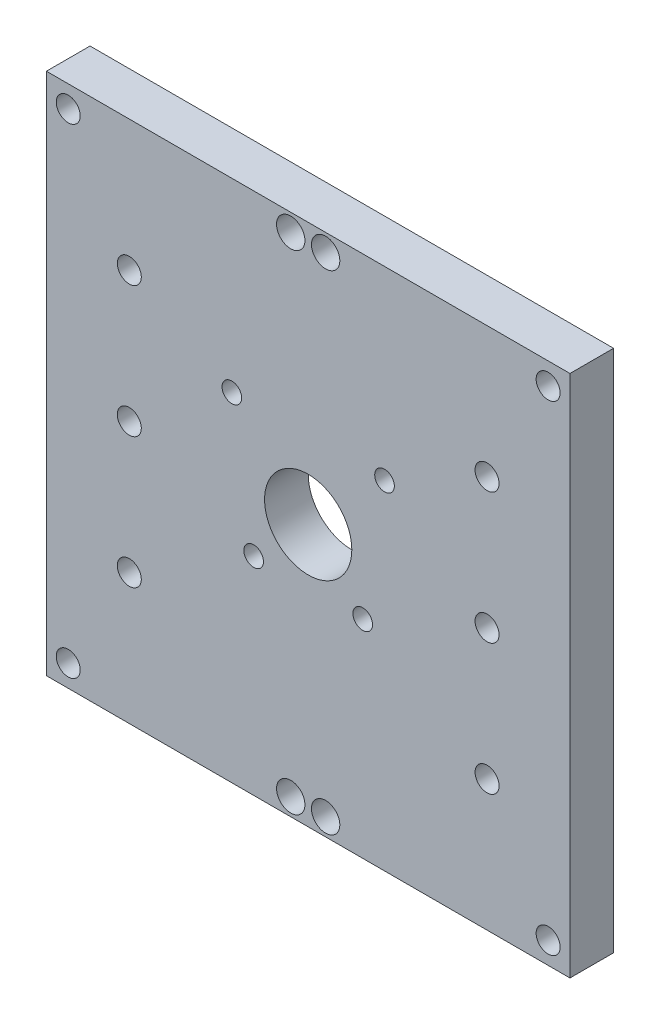
ISO-10303-21;
HEADER;
FILE_DESCRIPTION(('STEP AP214'),'2;1');
FILE_NAME('part.step','',(''),(''),'','','');
FILE_SCHEMA(('AUTOMOTIVE_DESIGN { 1 0 10303 214 1 1 1 1 }'));
ENDSEC;
DATA;
#1=APPLICATION_CONTEXT('core data for automotive mechanical design processes');
#2=APPLICATION_PROTOCOL_DEFINITION('international standard','automotive_design',2000,#1);
#3=PRODUCT_CONTEXT('',#1,'mechanical');
#4=PRODUCT('Part','Part','',(#3));
#5=PRODUCT_RELATED_PRODUCT_CATEGORY('part','',(#4));
#6=PRODUCT_DEFINITION_FORMATION('','',#4);
#7=PRODUCT_DEFINITION_CONTEXT('part definition',#1,'design');
#8=PRODUCT_DEFINITION('design','',#6,#7);
#9=PRODUCT_DEFINITION_SHAPE('','',#8);
#10=(LENGTH_UNIT() NAMED_UNIT(*) SI_UNIT(.MILLI.,.METRE.));
#11=(NAMED_UNIT(*) PLANE_ANGLE_UNIT() SI_UNIT($,.RADIAN.));
#12=(NAMED_UNIT(*) SI_UNIT($,.STERADIAN.) SOLID_ANGLE_UNIT());
#13=UNCERTAINTY_MEASURE_WITH_UNIT(LENGTH_MEASURE(1.E-05),#10,'distance_accuracy_value','');
#14=(GEOMETRIC_REPRESENTATION_CONTEXT(3) GLOBAL_UNCERTAINTY_ASSIGNED_CONTEXT((#13)) GLOBAL_UNIT_ASSIGNED_CONTEXT((#10,
#11,#12)) REPRESENTATION_CONTEXT('',''));
#15=CARTESIAN_POINT('',(0.,0.,0.));
#16=DIRECTION('',(0.,0.,1.));
#17=DIRECTION('',(1.,0.,0.));
#18=AXIS2_PLACEMENT_3D('',#15,#16,#17);
#19=CARTESIAN_POINT('',(60.,120.,5.));
#20=DIRECTION('',(-1.,0.,0.));
#21=DIRECTION('',(0.,0.,1.));
#22=AXIS2_PLACEMENT_3D('',#19,#20,#21);
#23=PLANE('',#22);
#24=DIRECTION('',(0.,0.,-1.));
#25=VECTOR('',#24,1.);
#26=CARTESIAN_POINT('',(60.,0.,5.));
#27=LINE('',#26,#25);
#28=CARTESIAN_POINT('',(60.,0.,5.));
#29=VERTEX_POINT('',#28);
#30=CARTESIAN_POINT('',(60.,0.,-5.));
#31=VERTEX_POINT('',#30);
#32=EDGE_CURVE('E98',#29,#31,#27,.T.);
#33=ORIENTED_EDGE('',*,*,#32,.T.);
#34=DIRECTION('',(0.,-1.,0.));
#35=VECTOR('',#34,1.);
#36=CARTESIAN_POINT('',(60.,120.,-5.));
#37=LINE('',#36,#35);
#38=CARTESIAN_POINT('',(60.,120.,-5.));
#39=VERTEX_POINT('',#38);
#40=EDGE_CURVE('E11',#39,#31,#37,.T.);
#41=ORIENTED_EDGE('',*,*,#40,.F.);
#42=DIRECTION('',(0.,0.,-1.));
#43=VECTOR('',#42,1.);
#44=CARTESIAN_POINT('',(60.,120.,5.));
#45=LINE('',#44,#43);
#46=CARTESIAN_POINT('',(60.,120.,5.));
#47=VERTEX_POINT('',#46);
#48=EDGE_CURVE('E86',#47,#39,#45,.T.);
#49=ORIENTED_EDGE('',*,*,#48,.F.);
#50=DIRECTION('',(0.,-1.,0.));
#51=VECTOR('',#50,1.);
#52=CARTESIAN_POINT('',(60.,120.,5.));
#53=LINE('',#52,#51);
#54=EDGE_CURVE('E94',#47,#29,#53,.T.);
#55=ORIENTED_EDGE('',*,*,#54,.T.);
#56=EDGE_LOOP('',(#33,#41,#49,#55));
#57=FACE_BOUND('',#56,.T.);
#58=ADVANCED_FACE('F35',(#57),#23,.F.);
#59=CARTESIAN_POINT('',(-60.,120.,-5.));
#60=DIRECTION('',(0.,0.,1.));
#61=DIRECTION('',(1.,0.,0.));
#62=AXIS2_PLACEMENT_3D('',#59,#60,#61);
#63=PLANE('',#62);
#64=CARTESIAN_POINT('',(-55.,115.,-5.));
#65=DIRECTION('',(0.,0.,1.));
#66=DIRECTION('',(1.,0.,0.));
#67=AXIS2_PLACEMENT_3D('',#64,#65,#66);
#68=CIRCLE('',#67,2.75);
#69=CARTESIAN_POINT('',(-52.25,115.,-5.));
#70=VERTEX_POINT('',#69);
#71=EDGE_CURVE('E118',#70,#70,#68,.T.);
#72=ORIENTED_EDGE('',*,*,#71,.T.);
#73=EDGE_LOOP('',(#72));
#74=FACE_BOUND('',#73,.T.);
#75=CARTESIAN_POINT('',(-55.,5.,-5.));
#76=DIRECTION('',(0.,0.,1.));
#77=DIRECTION('',(1.,0.,0.));
#78=AXIS2_PLACEMENT_3D('',#75,#76,#77);
#79=CIRCLE('',#78,2.75);
#80=CARTESIAN_POINT('',(-52.25,5.,-5.));
#81=VERTEX_POINT('',#80);
#82=EDGE_CURVE('E124',#81,#81,#79,.T.);
#83=ORIENTED_EDGE('',*,*,#82,.T.);
#84=EDGE_LOOP('',(#83));
#85=FACE_BOUND('',#84,.T.);
#86=CARTESIAN_POINT('',(-41.,60.,-5.));
#87=DIRECTION('',(0.,0.,1.));
#88=DIRECTION('',(1.,0.,0.));
#89=AXIS2_PLACEMENT_3D('',#86,#87,#88);
#90=CIRCLE('',#89,2.75);
#91=CARTESIAN_POINT('',(-38.25,60.,-5.));
#92=VERTEX_POINT('',#91);
#93=EDGE_CURVE('E155',#92,#92,#90,.T.);
#94=ORIENTED_EDGE('',*,*,#93,.T.);
#95=EDGE_LOOP('',(#94));
#96=FACE_BOUND('',#95,.T.);
#97=CARTESIAN_POINT('',(-41.0000000000001,90.,-5.));
#98=DIRECTION('',(0.,0.,1.));
#99=DIRECTION('',(1.,0.,0.));
#100=AXIS2_PLACEMENT_3D('',#97,#98,#99);
#101=CIRCLE('',#100,2.75);
#102=CARTESIAN_POINT('',(-38.2500000000001,90.,-5.));
#103=VERTEX_POINT('',#102);
#104=EDGE_CURVE('E162',#103,#103,#101,.T.);
#105=ORIENTED_EDGE('',*,*,#104,.T.);
#106=EDGE_LOOP('',(#105));
#107=FACE_BOUND('',#106,.T.);
#108=CARTESIAN_POINT('',(0.,60.,-5.));
#109=DIRECTION('',(0.,0.,1.));
#110=DIRECTION('',(1.,0.,0.));
#111=AXIS2_PLACEMENT_3D('',#108,#109,#110);
#112=CIRCLE('',#111,10.);
#113=CARTESIAN_POINT('',(10.,60.,-5.));
#114=VERTEX_POINT('',#113);
#115=EDGE_CURVE('E168',#114,#114,#112,.T.);
#116=ORIENTED_EDGE('',*,*,#115,.T.);
#117=EDGE_LOOP('',(#116));
#118=FACE_BOUND('',#117,.T.);
#119=CARTESIAN_POINT('',(55.,115.,-5.));
#120=DIRECTION('',(0.,0.,1.));
#121=DIRECTION('',(1.,0.,0.));
#122=AXIS2_PLACEMENT_3D('',#119,#120,#121);
#123=CIRCLE('',#122,2.75);
#124=CARTESIAN_POINT('',(57.75,115.,-5.));
#125=VERTEX_POINT('',#124);
#126=EDGE_CURVE('E174',#125,#125,#123,.T.);
#127=ORIENTED_EDGE('',*,*,#126,.T.);
#128=EDGE_LOOP('',(#127));
#129=FACE_BOUND('',#128,.T.);
#130=CARTESIAN_POINT('',(55.,5.,-5.));
#131=DIRECTION('',(0.,0.,1.));
#132=DIRECTION('',(1.,0.,0.));
#133=AXIS2_PLACEMENT_3D('',#130,#131,#132);
#134=CIRCLE('',#133,2.75);
#135=CARTESIAN_POINT('',(57.75,5.,-5.));
#136=VERTEX_POINT('',#135);
#137=EDGE_CURVE('E131',#136,#136,#134,.T.);
#138=ORIENTED_EDGE('',*,*,#137,.T.);
#139=EDGE_LOOP('',(#138));
#140=FACE_BOUND('',#139,.T.);
#141=CARTESIAN_POINT('',(17.5,77.5,-5.));
#142=DIRECTION('',(0.,0.,1.));
#143=DIRECTION('',(1.,0.,0.));
#144=AXIS2_PLACEMENT_3D('',#141,#142,#143);
#145=CIRCLE('',#144,2.25);
#146=CARTESIAN_POINT('',(19.75,77.5,-5.));
#147=VERTEX_POINT('',#146);
#148=EDGE_CURVE('E138',#147,#147,#145,.T.);
#149=ORIENTED_EDGE('',*,*,#148,.T.);
#150=EDGE_LOOP('',(#149));
#151=FACE_BOUND('',#150,.T.);
#152=CARTESIAN_POINT('',(12.5,47.5,-5.));
#153=DIRECTION('',(0.,0.,1.));
#154=DIRECTION('',(1.,0.,0.));
#155=AXIS2_PLACEMENT_3D('',#152,#153,#154);
#156=CIRCLE('',#155,2.25);
#157=CARTESIAN_POINT('',(14.75,47.5,-5.));
#158=VERTEX_POINT('',#157);
#159=EDGE_CURVE('E144',#158,#158,#156,.T.);
#160=ORIENTED_EDGE('',*,*,#159,.T.);
#161=EDGE_LOOP('',(#160));
#162=FACE_BOUND('',#161,.T.);
#163=CARTESIAN_POINT('',(-12.5,47.5,-5.));
#164=DIRECTION('',(0.,0.,1.));
#165=DIRECTION('',(1.,0.,0.));
#166=AXIS2_PLACEMENT_3D('',#163,#164,#165);
#167=CIRCLE('',#166,2.25);
#168=CARTESIAN_POINT('',(-10.25,47.5,-5.));
#169=VERTEX_POINT('',#168);
#170=EDGE_CURVE('E150',#169,#169,#167,.T.);
#171=ORIENTED_EDGE('',*,*,#170,.T.);
#172=EDGE_LOOP('',(#171));
#173=FACE_BOUND('',#172,.T.);
#174=CARTESIAN_POINT('',(3.99999999999999,4.,-5.));
#175=DIRECTION('',(0.,0.,1.));
#176=DIRECTION('',(1.,0.,0.));
#177=AXIS2_PLACEMENT_3D('',#174,#175,#176);
#178=CIRCLE('',#177,3.25);
#179=CARTESIAN_POINT('',(7.24999999999999,4.,-5.));
#180=VERTEX_POINT('',#179);
#181=EDGE_CURVE('E130',#180,#180,#178,.T.);
#182=ORIENTED_EDGE('',*,*,#181,.T.);
#183=EDGE_LOOP('',(#182));
#184=FACE_BOUND('',#183,.T.);
#185=CARTESIAN_POINT('',(-4.00000000000001,4.,-5.));
#186=DIRECTION('',(0.,0.,1.));
#187=DIRECTION('',(1.,0.,0.));
#188=AXIS2_PLACEMENT_3D('',#185,#186,#187);
#189=CIRCLE('',#188,3.25);
#190=CARTESIAN_POINT('',(-0.750000000000007,4.,-5.));
#191=VERTEX_POINT('',#190);
#192=EDGE_CURVE('E208',#191,#191,#189,.T.);
#193=ORIENTED_EDGE('',*,*,#192,.T.);
#194=EDGE_LOOP('',(#193));
#195=FACE_BOUND('',#194,.T.);
#196=CARTESIAN_POINT('',(41.,90.,-5.));
#197=DIRECTION('',(0.,0.,1.));
#198=DIRECTION('',(1.,0.,0.));
#199=AXIS2_PLACEMENT_3D('',#196,#197,#198);
#200=CIRCLE('',#199,2.75);
#201=CARTESIAN_POINT('',(43.75,90.,-5.));
#202=VERTEX_POINT('',#201);
#203=EDGE_CURVE('E214',#202,#202,#200,.T.);
#204=ORIENTED_EDGE('',*,*,#203,.T.);
#205=EDGE_LOOP('',(#204));
#206=FACE_BOUND('',#205,.T.);
#207=CARTESIAN_POINT('',(3.99999999999999,116.,-5.));
#208=DIRECTION('',(0.,0.,1.));
#209=DIRECTION('',(1.,0.,0.));
#210=AXIS2_PLACEMENT_3D('',#207,#208,#209);
#211=CIRCLE('',#210,3.25);
#212=CARTESIAN_POINT('',(7.24999999999999,116.,-5.));
#213=VERTEX_POINT('',#212);
#214=EDGE_CURVE('E220',#213,#213,#211,.T.);
#215=ORIENTED_EDGE('',*,*,#214,.T.);
#216=EDGE_LOOP('',(#215));
#217=FACE_BOUND('',#216,.T.);
#218=CARTESIAN_POINT('',(-4.00000000000001,116.,-5.));
#219=DIRECTION('',(0.,0.,1.));
#220=DIRECTION('',(1.,0.,0.));
#221=AXIS2_PLACEMENT_3D('',#218,#219,#220);
#222=CIRCLE('',#221,3.25);
#223=CARTESIAN_POINT('',(-0.750000000000006,116.,-5.));
#224=VERTEX_POINT('',#223);
#225=EDGE_CURVE('E179',#224,#224,#222,.T.);
#226=ORIENTED_EDGE('',*,*,#225,.T.);
#227=EDGE_LOOP('',(#226));
#228=FACE_BOUND('',#227,.T.);
#229=CARTESIAN_POINT('',(41.,60.,-5.));
#230=DIRECTION('',(0.,0.,1.));
#231=DIRECTION('',(1.,0.,0.));
#232=AXIS2_PLACEMENT_3D('',#229,#230,#231);
#233=CIRCLE('',#232,2.75);
#234=CARTESIAN_POINT('',(43.75,60.,-5.));
#235=VERTEX_POINT('',#234);
#236=EDGE_CURVE('E186',#235,#235,#233,.T.);
#237=ORIENTED_EDGE('',*,*,#236,.T.);
#238=EDGE_LOOP('',(#237));
#239=FACE_BOUND('',#238,.T.);
#240=CARTESIAN_POINT('',(41.,30.,-5.));
#241=DIRECTION('',(0.,0.,1.));
#242=DIRECTION('',(1.,0.,0.));
#243=AXIS2_PLACEMENT_3D('',#240,#241,#242);
#244=CIRCLE('',#243,2.75);
#245=CARTESIAN_POINT('',(43.75,30.,-5.));
#246=VERTEX_POINT('',#245);
#247=EDGE_CURVE('E192',#246,#246,#244,.T.);
#248=ORIENTED_EDGE('',*,*,#247,.T.);
#249=EDGE_LOOP('',(#248));
#250=FACE_BOUND('',#249,.T.);
#251=CARTESIAN_POINT('',(-40.9999999999999,30.,-5.));
#252=DIRECTION('',(0.,0.,1.));
#253=DIRECTION('',(1.,0.,0.));
#254=AXIS2_PLACEMENT_3D('',#251,#252,#253);
#255=CIRCLE('',#254,2.75);
#256=CARTESIAN_POINT('',(-38.2499999999999,30.,-5.));
#257=VERTEX_POINT('',#256);
#258=EDGE_CURVE('E198',#257,#257,#255,.T.);
#259=ORIENTED_EDGE('',*,*,#258,.T.);
#260=EDGE_LOOP('',(#259));
#261=FACE_BOUND('',#260,.T.);
#262=CARTESIAN_POINT('',(-17.5,77.5,-5.));
#263=DIRECTION('',(0.,0.,1.));
#264=DIRECTION('',(1.,0.,0.));
#265=AXIS2_PLACEMENT_3D('',#262,#263,#264);
#266=CIRCLE('',#265,2.25);
#267=CARTESIAN_POINT('',(-15.25,77.5,-5.));
#268=VERTEX_POINT('',#267);
#269=EDGE_CURVE('E101',#268,#268,#266,.T.);
#270=ORIENTED_EDGE('',*,*,#269,.T.);
#271=EDGE_LOOP('',(#270));
#272=FACE_BOUND('',#271,.T.);
#273=DIRECTION('',(-1.,0.,0.));
#274=VECTOR('',#273,1.);
#275=CARTESIAN_POINT('',(-60.,0.,-5.));
#276=LINE('',#275,#274);
#277=CARTESIAN_POINT('',(-60.,0.,-5.));
#278=VERTEX_POINT('',#277);
#279=EDGE_CURVE('E90',#31,#278,#276,.T.);
#280=ORIENTED_EDGE('',*,*,#279,.T.);
#281=DIRECTION('',(0.,-1.,0.));
#282=VECTOR('',#281,1.);
#283=CARTESIAN_POINT('',(-60.,120.,-5.));
#284=LINE('',#283,#282);
#285=CARTESIAN_POINT('',(-60.,120.,-5.));
#286=VERTEX_POINT('',#285);
#287=EDGE_CURVE('E43',#286,#278,#284,.T.);
#288=ORIENTED_EDGE('',*,*,#287,.F.);
#289=DIRECTION('',(-1.,0.,0.));
#290=VECTOR('',#289,1.);
#291=CARTESIAN_POINT('',(-60.,120.,-5.));
#292=LINE('',#291,#290);
#293=EDGE_CURVE('E81',#39,#286,#292,.T.);
#294=ORIENTED_EDGE('',*,*,#293,.F.);
#295=ORIENTED_EDGE('',*,*,#40,.T.);
#296=EDGE_LOOP('',(#280,#288,#294,#295));
#297=FACE_BOUND('',#296,.T.);
#298=ADVANCED_FACE('F89',(#74,#85,#96,#107,#118,#129,#140,#151,#162,#173,#184,#195,#206,#217,
#228,#239,#250,#261,#272,#297),#63,.F.);
#299=CARTESIAN_POINT('',(-60.,120.,5.));
#300=DIRECTION('',(1.,0.,0.));
#301=DIRECTION('',(0.,0.,-1.));
#302=AXIS2_PLACEMENT_3D('',#299,#300,#301);
#303=PLANE('',#302);
#304=DIRECTION('',(0.,0.,1.));
#305=VECTOR('',#304,1.);
#306=CARTESIAN_POINT('',(-60.,0.,5.));
#307=LINE('',#306,#305);
#308=CARTESIAN_POINT('',(-60.,0.,5.));
#309=VERTEX_POINT('',#308);
#310=EDGE_CURVE('E68',#278,#309,#307,.T.);
#311=ORIENTED_EDGE('',*,*,#310,.T.);
#312=DIRECTION('',(0.,-1.,0.));
#313=VECTOR('',#312,1.);
#314=CARTESIAN_POINT('',(-60.,120.,5.));
#315=LINE('',#314,#313);
#316=CARTESIAN_POINT('',(-60.,120.,5.));
#317=VERTEX_POINT('',#316);
#318=EDGE_CURVE('E91',#317,#309,#315,.T.);
#319=ORIENTED_EDGE('',*,*,#318,.F.);
#320=DIRECTION('',(0.,0.,1.));
#321=VECTOR('',#320,1.);
#322=CARTESIAN_POINT('',(-60.,120.,5.));
#323=LINE('',#322,#321);
#324=EDGE_CURVE('E84',#286,#317,#323,.T.);
#325=ORIENTED_EDGE('',*,*,#324,.F.);
#326=ORIENTED_EDGE('',*,*,#287,.T.);
#327=EDGE_LOOP('',(#311,#319,#325,#326));
#328=FACE_BOUND('',#327,.T.);
#329=ADVANCED_FACE('F92',(#328),#303,.F.);
#330=CARTESIAN_POINT('',(-60.,120.,5.));
#331=DIRECTION('',(0.,0.,-1.));
#332=DIRECTION('',(-1.,0.,0.));
#333=AXIS2_PLACEMENT_3D('',#330,#331,#332);
#334=PLANE('',#333);
#335=CARTESIAN_POINT('',(-55.,115.,5.));
#336=DIRECTION('',(0.,0.,1.));
#337=DIRECTION('',(1.,0.,0.));
#338=AXIS2_PLACEMENT_3D('',#335,#336,#337);
#339=CIRCLE('',#338,2.75);
#340=CARTESIAN_POINT('',(-52.25,115.,5.));
#341=VERTEX_POINT('',#340);
#342=EDGE_CURVE('E121',#341,#341,#339,.T.);
#343=ORIENTED_EDGE('',*,*,#342,.F.);
#344=EDGE_LOOP('',(#343));
#345=FACE_BOUND('',#344,.T.);
#346=CARTESIAN_POINT('',(-55.,5.,5.));
#347=DIRECTION('',(0.,0.,1.));
#348=DIRECTION('',(1.,0.,0.));
#349=AXIS2_PLACEMENT_3D('',#346,#347,#348);
#350=CIRCLE('',#349,2.75);
#351=CARTESIAN_POINT('',(-52.25,5.,5.));
#352=VERTEX_POINT('',#351);
#353=EDGE_CURVE('E127',#352,#352,#350,.T.);
#354=ORIENTED_EDGE('',*,*,#353,.F.);
#355=EDGE_LOOP('',(#354));
#356=FACE_BOUND('',#355,.T.);
#357=CARTESIAN_POINT('',(-41.,60.,5.));
#358=DIRECTION('',(0.,0.,1.));
#359=DIRECTION('',(1.,0.,0.));
#360=AXIS2_PLACEMENT_3D('',#357,#358,#359);
#361=CIRCLE('',#360,2.75);
#362=CARTESIAN_POINT('',(-38.25,60.,5.));
#363=VERTEX_POINT('',#362);
#364=EDGE_CURVE('E158',#363,#363,#361,.T.);
#365=ORIENTED_EDGE('',*,*,#364,.F.);
#366=EDGE_LOOP('',(#365));
#367=FACE_BOUND('',#366,.T.);
#368=CARTESIAN_POINT('',(-41.0000000000001,90.,5.));
#369=DIRECTION('',(0.,0.,1.));
#370=DIRECTION('',(1.,0.,0.));
#371=AXIS2_PLACEMENT_3D('',#368,#369,#370);
#372=CIRCLE('',#371,2.75);
#373=CARTESIAN_POINT('',(-38.2500000000001,90.,5.));
#374=VERTEX_POINT('',#373);
#375=EDGE_CURVE('E165',#374,#374,#372,.T.);
#376=ORIENTED_EDGE('',*,*,#375,.F.);
#377=EDGE_LOOP('',(#376));
#378=FACE_BOUND('',#377,.T.);
#379=CARTESIAN_POINT('',(0.,60.,5.));
#380=DIRECTION('',(0.,0.,1.));
#381=DIRECTION('',(1.,0.,0.));
#382=AXIS2_PLACEMENT_3D('',#379,#380,#381);
#383=CIRCLE('',#382,10.);
#384=CARTESIAN_POINT('',(10.,60.,5.));
#385=VERTEX_POINT('',#384);
#386=EDGE_CURVE('E171',#385,#385,#383,.T.);
#387=ORIENTED_EDGE('',*,*,#386,.F.);
#388=EDGE_LOOP('',(#387));
#389=FACE_BOUND('',#388,.T.);
#390=CARTESIAN_POINT('',(55.,115.,5.));
#391=DIRECTION('',(0.,0.,1.));
#392=DIRECTION('',(1.,0.,0.));
#393=AXIS2_PLACEMENT_3D('',#390,#391,#392);
#394=CIRCLE('',#393,2.75);
#395=CARTESIAN_POINT('',(57.75,115.,5.));
#396=VERTEX_POINT('',#395);
#397=EDGE_CURVE('E135',#396,#396,#394,.T.);
#398=ORIENTED_EDGE('',*,*,#397,.F.);
#399=EDGE_LOOP('',(#398));
#400=FACE_BOUND('',#399,.T.);
#401=CARTESIAN_POINT('',(55.,5.,5.));
#402=DIRECTION('',(0.,0.,1.));
#403=DIRECTION('',(1.,0.,0.));
#404=AXIS2_PLACEMENT_3D('',#401,#402,#403);
#405=CIRCLE('',#404,2.75);
#406=CARTESIAN_POINT('',(57.75,5.,5.));
#407=VERTEX_POINT('',#406);
#408=EDGE_CURVE('E134',#407,#407,#405,.T.);
#409=ORIENTED_EDGE('',*,*,#408,.F.);
#410=EDGE_LOOP('',(#409));
#411=FACE_BOUND('',#410,.T.);
#412=CARTESIAN_POINT('',(17.5,77.5,5.));
#413=DIRECTION('',(0.,0.,1.));
#414=DIRECTION('',(1.,0.,0.));
#415=AXIS2_PLACEMENT_3D('',#412,#413,#414);
#416=CIRCLE('',#415,2.25);
#417=CARTESIAN_POINT('',(19.75,77.5,5.));
#418=VERTEX_POINT('',#417);
#419=EDGE_CURVE('E141',#418,#418,#416,.T.);
#420=ORIENTED_EDGE('',*,*,#419,.F.);
#421=EDGE_LOOP('',(#420));
#422=FACE_BOUND('',#421,.T.);
#423=CARTESIAN_POINT('',(12.5,47.5,5.));
#424=DIRECTION('',(0.,0.,1.));
#425=DIRECTION('',(1.,0.,0.));
#426=AXIS2_PLACEMENT_3D('',#423,#424,#425);
#427=CIRCLE('',#426,2.25);
#428=CARTESIAN_POINT('',(14.75,47.5,5.));
#429=VERTEX_POINT('',#428);
#430=EDGE_CURVE('E147',#429,#429,#427,.T.);
#431=ORIENTED_EDGE('',*,*,#430,.F.);
#432=EDGE_LOOP('',(#431));
#433=FACE_BOUND('',#432,.T.);
#434=CARTESIAN_POINT('',(-12.5,47.5,5.));
#435=DIRECTION('',(0.,0.,1.));
#436=DIRECTION('',(1.,0.,0.));
#437=AXIS2_PLACEMENT_3D('',#434,#435,#436);
#438=CIRCLE('',#437,2.25);
#439=CARTESIAN_POINT('',(-10.25,47.5,5.));
#440=VERTEX_POINT('',#439);
#441=EDGE_CURVE('E115',#440,#440,#438,.T.);
#442=ORIENTED_EDGE('',*,*,#441,.F.);
#443=EDGE_LOOP('',(#442));
#444=FACE_BOUND('',#443,.T.);
#445=CARTESIAN_POINT('',(3.99999999999999,4.,5.));
#446=DIRECTION('',(0.,0.,1.));
#447=DIRECTION('',(1.,0.,0.));
#448=AXIS2_PLACEMENT_3D('',#445,#446,#447);
#449=CIRCLE('',#448,3.25);
#450=CARTESIAN_POINT('',(7.24999999999999,4.,5.));
#451=VERTEX_POINT('',#450);
#452=EDGE_CURVE('E205',#451,#451,#449,.T.);
#453=ORIENTED_EDGE('',*,*,#452,.F.);
#454=EDGE_LOOP('',(#453));
#455=FACE_BOUND('',#454,.T.);
#456=CARTESIAN_POINT('',(-4.00000000000001,4.,5.));
#457=DIRECTION('',(0.,0.,1.));
#458=DIRECTION('',(1.,0.,0.));
#459=AXIS2_PLACEMENT_3D('',#456,#457,#458);
#460=CIRCLE('',#459,3.25);
#461=CARTESIAN_POINT('',(-0.750000000000007,4.,5.));
#462=VERTEX_POINT('',#461);
#463=EDGE_CURVE('E211',#462,#462,#460,.T.);
#464=ORIENTED_EDGE('',*,*,#463,.F.);
#465=EDGE_LOOP('',(#464));
#466=FACE_BOUND('',#465,.T.);
#467=CARTESIAN_POINT('',(41.,90.,5.));
#468=DIRECTION('',(0.,0.,1.));
#469=DIRECTION('',(1.,0.,0.));
#470=AXIS2_PLACEMENT_3D('',#467,#468,#469);
#471=CIRCLE('',#470,2.75);
#472=CARTESIAN_POINT('',(43.75,90.,5.));
#473=VERTEX_POINT('',#472);
#474=EDGE_CURVE('E217',#473,#473,#471,.T.);
#475=ORIENTED_EDGE('',*,*,#474,.F.);
#476=EDGE_LOOP('',(#475));
#477=FACE_BOUND('',#476,.T.);
#478=CARTESIAN_POINT('',(3.99999999999999,116.,5.));
#479=DIRECTION('',(0.,0.,1.));
#480=DIRECTION('',(1.,0.,0.));
#481=AXIS2_PLACEMENT_3D('',#478,#479,#480);
#482=CIRCLE('',#481,3.25);
#483=CARTESIAN_POINT('',(7.24999999999999,116.,5.));
#484=VERTEX_POINT('',#483);
#485=EDGE_CURVE('E183',#484,#484,#482,.T.);
#486=ORIENTED_EDGE('',*,*,#485,.F.);
#487=EDGE_LOOP('',(#486));
#488=FACE_BOUND('',#487,.T.);
#489=CARTESIAN_POINT('',(-4.00000000000001,116.,5.));
#490=DIRECTION('',(0.,0.,1.));
#491=DIRECTION('',(1.,0.,0.));
#492=AXIS2_PLACEMENT_3D('',#489,#490,#491);
#493=CIRCLE('',#492,3.25);
#494=CARTESIAN_POINT('',(-0.750000000000006,116.,5.));
#495=VERTEX_POINT('',#494);
#496=EDGE_CURVE('E182',#495,#495,#493,.T.);
#497=ORIENTED_EDGE('',*,*,#496,.F.);
#498=EDGE_LOOP('',(#497));
#499=FACE_BOUND('',#498,.T.);
#500=CARTESIAN_POINT('',(41.,60.,5.));
#501=DIRECTION('',(0.,0.,1.));
#502=DIRECTION('',(1.,0.,0.));
#503=AXIS2_PLACEMENT_3D('',#500,#501,#502);
#504=CIRCLE('',#503,2.75);
#505=CARTESIAN_POINT('',(43.75,60.,5.));
#506=VERTEX_POINT('',#505);
#507=EDGE_CURVE('E189',#506,#506,#504,.T.);
#508=ORIENTED_EDGE('',*,*,#507,.F.);
#509=EDGE_LOOP('',(#508));
#510=FACE_BOUND('',#509,.T.);
#511=CARTESIAN_POINT('',(41.,30.,5.));
#512=DIRECTION('',(0.,0.,1.));
#513=DIRECTION('',(1.,0.,0.));
#514=AXIS2_PLACEMENT_3D('',#511,#512,#513);
#515=CIRCLE('',#514,2.75);
#516=CARTESIAN_POINT('',(43.75,30.,5.));
#517=VERTEX_POINT('',#516);
#518=EDGE_CURVE('E195',#517,#517,#515,.T.);
#519=ORIENTED_EDGE('',*,*,#518,.F.);
#520=EDGE_LOOP('',(#519));
#521=FACE_BOUND('',#520,.T.);
#522=CARTESIAN_POINT('',(-40.9999999999999,30.,5.));
#523=DIRECTION('',(0.,0.,1.));
#524=DIRECTION('',(1.,0.,0.));
#525=AXIS2_PLACEMENT_3D('',#522,#523,#524);
#526=CIRCLE('',#525,2.75);
#527=CARTESIAN_POINT('',(-38.2499999999999,30.,5.));
#528=VERTEX_POINT('',#527);
#529=EDGE_CURVE('E159',#528,#528,#526,.T.);
#530=ORIENTED_EDGE('',*,*,#529,.F.);
#531=EDGE_LOOP('',(#530));
#532=FACE_BOUND('',#531,.T.);
#533=CARTESIAN_POINT('',(-17.5,77.5,5.));
#534=DIRECTION('',(0.,0.,1.));
#535=DIRECTION('',(1.,0.,0.));
#536=AXIS2_PLACEMENT_3D('',#533,#534,#535);
#537=CIRCLE('',#536,2.25);
#538=CARTESIAN_POINT('',(-15.25,77.5,5.));
#539=VERTEX_POINT('',#538);
#540=EDGE_CURVE('E112',#539,#539,#537,.T.);
#541=ORIENTED_EDGE('',*,*,#540,.F.);
#542=EDGE_LOOP('',(#541));
#543=FACE_BOUND('',#542,.T.);
#544=DIRECTION('',(1.,0.,0.));
#545=VECTOR('',#544,1.);
#546=CARTESIAN_POINT('',(-60.,0.,5.));
#547=LINE('',#546,#545);
#548=EDGE_CURVE('E74',#309,#29,#547,.T.);
#549=ORIENTED_EDGE('',*,*,#548,.T.);
#550=ORIENTED_EDGE('',*,*,#54,.F.);
#551=DIRECTION('',(1.,0.,0.));
#552=VECTOR('',#551,1.);
#553=CARTESIAN_POINT('',(-60.,120.,5.));
#554=LINE('',#553,#552);
#555=EDGE_CURVE('E51',#317,#47,#554,.T.);
#556=ORIENTED_EDGE('',*,*,#555,.F.);
#557=ORIENTED_EDGE('',*,*,#318,.T.);
#558=EDGE_LOOP('',(#549,#550,#556,#557));
#559=FACE_BOUND('',#558,.T.);
#560=ADVANCED_FACE('F106',(#345,#356,#367,#378,#389,#400,#411,#422,#433,#444,#455,#466,#477,
#488,#499,#510,#521,#532,#543,#559),#334,.F.);
#561=CARTESIAN_POINT('',(0.,120.,0.));
#562=DIRECTION('',(0.,-1.,0.));
#563=DIRECTION('',(0.,0.,-1.));
#564=AXIS2_PLACEMENT_3D('',#561,#562,#563);
#565=PLANE('',#564);
#566=ORIENTED_EDGE('',*,*,#48,.T.);
#567=ORIENTED_EDGE('',*,*,#293,.T.);
#568=ORIENTED_EDGE('',*,*,#324,.T.);
#569=ORIENTED_EDGE('',*,*,#555,.T.);
#570=EDGE_LOOP('',(#566,#567,#568,#569));
#571=FACE_BOUND('',#570,.T.);
#572=ADVANCED_FACE('F82',(#571),#565,.F.);
#573=CARTESIAN_POINT('',(0.,0.,0.));
#574=DIRECTION('',(0.,-1.,0.));
#575=DIRECTION('',(0.,0.,-1.));
#576=AXIS2_PLACEMENT_3D('',#573,#574,#575);
#577=PLANE('',#576);
#578=ORIENTED_EDGE('',*,*,#32,.F.);
#579=ORIENTED_EDGE('',*,*,#548,.F.);
#580=ORIENTED_EDGE('',*,*,#310,.F.);
#581=ORIENTED_EDGE('',*,*,#279,.F.);
#582=EDGE_LOOP('',(#578,#579,#580,#581));
#583=FACE_BOUND('',#582,.T.);
#584=ADVANCED_FACE('F109',(#583),#577,.T.);
#585=CARTESIAN_POINT('',(-17.5,77.5,-5.));
#586=DIRECTION('',(0.,0.,1.));
#587=DIRECTION('',(1.,0.,0.));
#588=AXIS2_PLACEMENT_3D('',#585,#586,#587);
#589=CYLINDRICAL_SURFACE('',#588,2.25);
#590=ORIENTED_EDGE('',*,*,#269,.F.);
#591=EDGE_LOOP('',(#590));
#592=FACE_BOUND('',#591,.T.);
#593=ORIENTED_EDGE('',*,*,#540,.T.);
#594=EDGE_LOOP('',(#593));
#595=FACE_BOUND('',#594,.T.);
#596=ADVANCED_FACE('F242',(#592,#595),#589,.F.);
#597=CARTESIAN_POINT('',(-40.9999999999999,30.,-5.));
#598=DIRECTION('',(0.,0.,1.));
#599=DIRECTION('',(1.,0.,0.));
#600=AXIS2_PLACEMENT_3D('',#597,#598,#599);
#601=CYLINDRICAL_SURFACE('',#600,2.75);
#602=ORIENTED_EDGE('',*,*,#258,.F.);
#603=EDGE_LOOP('',(#602));
#604=FACE_BOUND('',#603,.T.);
#605=ORIENTED_EDGE('',*,*,#529,.T.);
#606=EDGE_LOOP('',(#605));
#607=FACE_BOUND('',#606,.T.);
#608=ADVANCED_FACE('F244',(#604,#607),#601,.F.);
#609=CARTESIAN_POINT('',(41.,30.,-5.));
#610=DIRECTION('',(0.,0.,1.));
#611=DIRECTION('',(1.,0.,0.));
#612=AXIS2_PLACEMENT_3D('',#609,#610,#611);
#613=CYLINDRICAL_SURFACE('',#612,2.75);
#614=ORIENTED_EDGE('',*,*,#247,.F.);
#615=EDGE_LOOP('',(#614));
#616=FACE_BOUND('',#615,.T.);
#617=ORIENTED_EDGE('',*,*,#518,.T.);
#618=EDGE_LOOP('',(#617));
#619=FACE_BOUND('',#618,.T.);
#620=ADVANCED_FACE('F251',(#616,#619),#613,.F.);
#621=CARTESIAN_POINT('',(41.,60.,-5.));
#622=DIRECTION('',(0.,0.,1.));
#623=DIRECTION('',(1.,0.,0.));
#624=AXIS2_PLACEMENT_3D('',#621,#622,#623);
#625=CYLINDRICAL_SURFACE('',#624,2.75);
#626=ORIENTED_EDGE('',*,*,#236,.F.);
#627=EDGE_LOOP('',(#626));
#628=FACE_BOUND('',#627,.T.);
#629=ORIENTED_EDGE('',*,*,#507,.T.);
#630=EDGE_LOOP('',(#629));
#631=FACE_BOUND('',#630,.T.);
#632=ADVANCED_FACE('F307',(#628,#631),#625,.F.);
#633=CARTESIAN_POINT('',(-4.00000000000001,116.,-5.));
#634=DIRECTION('',(0.,0.,1.));
#635=DIRECTION('',(1.,0.,0.));
#636=AXIS2_PLACEMENT_3D('',#633,#634,#635);
#637=CYLINDRICAL_SURFACE('',#636,3.25);
#638=ORIENTED_EDGE('',*,*,#225,.F.);
#639=EDGE_LOOP('',(#638));
#640=FACE_BOUND('',#639,.T.);
#641=ORIENTED_EDGE('',*,*,#496,.T.);
#642=EDGE_LOOP('',(#641));
#643=FACE_BOUND('',#642,.T.);
#644=ADVANCED_FACE('F317',(#640,#643),#637,.F.);
#645=CARTESIAN_POINT('',(3.99999999999999,116.,-5.));
#646=DIRECTION('',(0.,0.,1.));
#647=DIRECTION('',(1.,0.,0.));
#648=AXIS2_PLACEMENT_3D('',#645,#646,#647);
#649=CYLINDRICAL_SURFACE('',#648,3.25);
#650=ORIENTED_EDGE('',*,*,#214,.F.);
#651=EDGE_LOOP('',(#650));
#652=FACE_BOUND('',#651,.T.);
#653=ORIENTED_EDGE('',*,*,#485,.T.);
#654=EDGE_LOOP('',(#653));
#655=FACE_BOUND('',#654,.T.);
#656=ADVANCED_FACE('F226',(#652,#655),#649,.F.);
#657=CARTESIAN_POINT('',(41.,90.,-5.));
#658=DIRECTION('',(0.,0.,1.));
#659=DIRECTION('',(1.,0.,0.));
#660=AXIS2_PLACEMENT_3D('',#657,#658,#659);
#661=CYLINDRICAL_SURFACE('',#660,2.75);
#662=ORIENTED_EDGE('',*,*,#203,.F.);
#663=EDGE_LOOP('',(#662));
#664=FACE_BOUND('',#663,.T.);
#665=ORIENTED_EDGE('',*,*,#474,.T.);
#666=EDGE_LOOP('',(#665));
#667=FACE_BOUND('',#666,.T.);
#668=ADVANCED_FACE('F336',(#664,#667),#661,.F.);
#669=CARTESIAN_POINT('',(-4.00000000000001,4.,-5.));
#670=DIRECTION('',(0.,0.,1.));
#671=DIRECTION('',(1.,0.,0.));
#672=AXIS2_PLACEMENT_3D('',#669,#670,#671);
#673=CYLINDRICAL_SURFACE('',#672,3.25);
#674=ORIENTED_EDGE('',*,*,#192,.F.);
#675=EDGE_LOOP('',(#674));
#676=FACE_BOUND('',#675,.T.);
#677=ORIENTED_EDGE('',*,*,#463,.T.);
#678=EDGE_LOOP('',(#677));
#679=FACE_BOUND('',#678,.T.);
#680=ADVANCED_FACE('F346',(#676,#679),#673,.F.);
#681=CARTESIAN_POINT('',(3.99999999999999,4.,-5.));
#682=DIRECTION('',(0.,0.,1.));
#683=DIRECTION('',(1.,0.,0.));
#684=AXIS2_PLACEMENT_3D('',#681,#682,#683);
#685=CYLINDRICAL_SURFACE('',#684,3.25);
#686=ORIENTED_EDGE('',*,*,#181,.F.);
#687=EDGE_LOOP('',(#686));
#688=FACE_BOUND('',#687,.T.);
#689=ORIENTED_EDGE('',*,*,#452,.T.);
#690=EDGE_LOOP('',(#689));
#691=FACE_BOUND('',#690,.T.);
#692=ADVANCED_FACE('F356',(#688,#691),#685,.F.);
#693=CARTESIAN_POINT('',(-12.5,47.5,-5.));
#694=DIRECTION('',(0.,0.,1.));
#695=DIRECTION('',(1.,0.,0.));
#696=AXIS2_PLACEMENT_3D('',#693,#694,#695);
#697=CYLINDRICAL_SURFACE('',#696,2.25);
#698=ORIENTED_EDGE('',*,*,#170,.F.);
#699=EDGE_LOOP('',(#698));
#700=FACE_BOUND('',#699,.T.);
#701=ORIENTED_EDGE('',*,*,#441,.T.);
#702=EDGE_LOOP('',(#701));
#703=FACE_BOUND('',#702,.T.);
#704=ADVANCED_FACE('F366',(#700,#703),#697,.F.);
#705=CARTESIAN_POINT('',(12.5,47.5,-5.));
#706=DIRECTION('',(0.,0.,1.));
#707=DIRECTION('',(1.,0.,0.));
#708=AXIS2_PLACEMENT_3D('',#705,#706,#707);
#709=CYLINDRICAL_SURFACE('',#708,2.25);
#710=ORIENTED_EDGE('',*,*,#159,.F.);
#711=EDGE_LOOP('',(#710));
#712=FACE_BOUND('',#711,.T.);
#713=ORIENTED_EDGE('',*,*,#430,.T.);
#714=EDGE_LOOP('',(#713));
#715=FACE_BOUND('',#714,.T.);
#716=ADVANCED_FACE('F376',(#712,#715),#709,.F.);
#717=CARTESIAN_POINT('',(17.5,77.5,-5.));
#718=DIRECTION('',(0.,0.,1.));
#719=DIRECTION('',(1.,0.,0.));
#720=AXIS2_PLACEMENT_3D('',#717,#718,#719);
#721=CYLINDRICAL_SURFACE('',#720,2.25);
#722=ORIENTED_EDGE('',*,*,#148,.F.);
#723=EDGE_LOOP('',(#722));
#724=FACE_BOUND('',#723,.T.);
#725=ORIENTED_EDGE('',*,*,#419,.T.);
#726=EDGE_LOOP('',(#725));
#727=FACE_BOUND('',#726,.T.);
#728=ADVANCED_FACE('F386',(#724,#727),#721,.F.);
#729=CARTESIAN_POINT('',(55.,5.,-5.));
#730=DIRECTION('',(0.,0.,1.));
#731=DIRECTION('',(1.,0.,0.));
#732=AXIS2_PLACEMENT_3D('',#729,#730,#731);
#733=CYLINDRICAL_SURFACE('',#732,2.75);
#734=ORIENTED_EDGE('',*,*,#137,.F.);
#735=EDGE_LOOP('',(#734));
#736=FACE_BOUND('',#735,.T.);
#737=ORIENTED_EDGE('',*,*,#408,.T.);
#738=EDGE_LOOP('',(#737));
#739=FACE_BOUND('',#738,.T.);
#740=ADVANCED_FACE('F396',(#736,#739),#733,.F.);
#741=CARTESIAN_POINT('',(55.,115.,-5.));
#742=DIRECTION('',(0.,0.,1.));
#743=DIRECTION('',(1.,0.,0.));
#744=AXIS2_PLACEMENT_3D('',#741,#742,#743);
#745=CYLINDRICAL_SURFACE('',#744,2.75);
#746=ORIENTED_EDGE('',*,*,#126,.F.);
#747=EDGE_LOOP('',(#746));
#748=FACE_BOUND('',#747,.T.);
#749=ORIENTED_EDGE('',*,*,#397,.T.);
#750=EDGE_LOOP('',(#749));
#751=FACE_BOUND('',#750,.T.);
#752=ADVANCED_FACE('F406',(#748,#751),#745,.F.);
#753=CARTESIAN_POINT('',(0.,60.,-5.));
#754=DIRECTION('',(0.,0.,1.));
#755=DIRECTION('',(1.,0.,0.));
#756=AXIS2_PLACEMENT_3D('',#753,#754,#755);
#757=CYLINDRICAL_SURFACE('',#756,10.);
#758=ORIENTED_EDGE('',*,*,#115,.F.);
#759=EDGE_LOOP('',(#758));
#760=FACE_BOUND('',#759,.T.);
#761=ORIENTED_EDGE('',*,*,#386,.T.);
#762=EDGE_LOOP('',(#761));
#763=FACE_BOUND('',#762,.T.);
#764=ADVANCED_FACE('F416',(#760,#763),#757,.F.);
#765=CARTESIAN_POINT('',(-41.0000000000001,90.,-5.));
#766=DIRECTION('',(0.,0.,1.));
#767=DIRECTION('',(1.,0.,0.));
#768=AXIS2_PLACEMENT_3D('',#765,#766,#767);
#769=CYLINDRICAL_SURFACE('',#768,2.75);
#770=ORIENTED_EDGE('',*,*,#104,.F.);
#771=EDGE_LOOP('',(#770));
#772=FACE_BOUND('',#771,.T.);
#773=ORIENTED_EDGE('',*,*,#375,.T.);
#774=EDGE_LOOP('',(#773));
#775=FACE_BOUND('',#774,.T.);
#776=ADVANCED_FACE('F426',(#772,#775),#769,.F.);
#777=CARTESIAN_POINT('',(-41.,60.,-5.));
#778=DIRECTION('',(0.,0.,1.));
#779=DIRECTION('',(1.,0.,0.));
#780=AXIS2_PLACEMENT_3D('',#777,#778,#779);
#781=CYLINDRICAL_SURFACE('',#780,2.75);
#782=ORIENTED_EDGE('',*,*,#93,.F.);
#783=EDGE_LOOP('',(#782));
#784=FACE_BOUND('',#783,.T.);
#785=ORIENTED_EDGE('',*,*,#364,.T.);
#786=EDGE_LOOP('',(#785));
#787=FACE_BOUND('',#786,.T.);
#788=ADVANCED_FACE('F436',(#784,#787),#781,.F.);
#789=CARTESIAN_POINT('',(-55.,5.,-5.));
#790=DIRECTION('',(0.,0.,1.));
#791=DIRECTION('',(1.,0.,0.));
#792=AXIS2_PLACEMENT_3D('',#789,#790,#791);
#793=CYLINDRICAL_SURFACE('',#792,2.75);
#794=ORIENTED_EDGE('',*,*,#82,.F.);
#795=EDGE_LOOP('',(#794));
#796=FACE_BOUND('',#795,.T.);
#797=ORIENTED_EDGE('',*,*,#353,.T.);
#798=EDGE_LOOP('',(#797));
#799=FACE_BOUND('',#798,.T.);
#800=ADVANCED_FACE('F446',(#796,#799),#793,.F.);
#801=CARTESIAN_POINT('',(-55.,115.,-5.));
#802=DIRECTION('',(0.,0.,1.));
#803=DIRECTION('',(1.,0.,0.));
#804=AXIS2_PLACEMENT_3D('',#801,#802,#803);
#805=CYLINDRICAL_SURFACE('',#804,2.75);
#806=ORIENTED_EDGE('',*,*,#71,.F.);
#807=EDGE_LOOP('',(#806));
#808=FACE_BOUND('',#807,.T.);
#809=ORIENTED_EDGE('',*,*,#342,.T.);
#810=EDGE_LOOP('',(#809));
#811=FACE_BOUND('',#810,.T.);
#812=ADVANCED_FACE('F456',(#808,#811),#805,.F.);
#813=CLOSED_SHELL('',(#58,#298,#329,#560,#572,#584,#596,#608,#620,#632,#644,#656,#668,#680,#692,
#704,#716,#728,#740,#752,#764,#776,#788,#800,#812));
#814=MANIFOLD_SOLID_BREP('B2',#813);
#815=ADVANCED_BREP_SHAPE_REPRESENTATION('',(#18,#814),#14);
#816=SHAPE_DEFINITION_REPRESENTATION(#9,#815);
ENDSEC;
END-ISO-10303-21;
